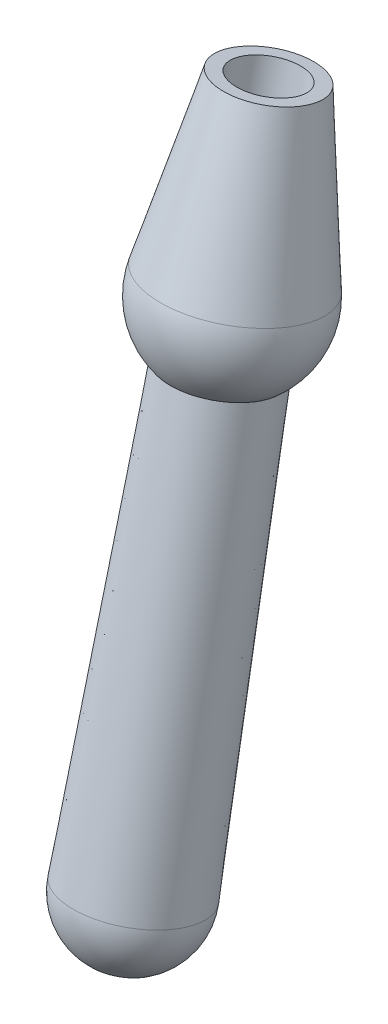
ISO-10303-21;
HEADER;
FILE_DESCRIPTION(('STEP AP214'),'2;1');
FILE_NAME('part.step','',(''),(''),'','','');
FILE_SCHEMA(('AUTOMOTIVE_DESIGN { 1 0 10303 214 1 1 1 1 }'));
ENDSEC;
DATA;
#1=APPLICATION_CONTEXT('core data for automotive mechanical design processes');
#2=APPLICATION_PROTOCOL_DEFINITION('international standard','automotive_design',2000,#1);
#3=PRODUCT_CONTEXT('',#1,'mechanical');
#4=PRODUCT('Part','Part','',(#3));
#5=PRODUCT_RELATED_PRODUCT_CATEGORY('part','',(#4));
#6=PRODUCT_DEFINITION_FORMATION('','',#4);
#7=PRODUCT_DEFINITION_CONTEXT('part definition',#1,'design');
#8=PRODUCT_DEFINITION('design','',#6,#7);
#9=PRODUCT_DEFINITION_SHAPE('','',#8);
#10=(LENGTH_UNIT() NAMED_UNIT(*) SI_UNIT(.MILLI.,.METRE.));
#11=(NAMED_UNIT(*) PLANE_ANGLE_UNIT() SI_UNIT($,.RADIAN.));
#12=(NAMED_UNIT(*) SI_UNIT($,.STERADIAN.) SOLID_ANGLE_UNIT());
#13=UNCERTAINTY_MEASURE_WITH_UNIT(LENGTH_MEASURE(1.E-05),#10,'distance_accuracy_value','');
#14=(GEOMETRIC_REPRESENTATION_CONTEXT(3) GLOBAL_UNCERTAINTY_ASSIGNED_CONTEXT((#13)) GLOBAL_UNIT_ASSIGNED_CONTEXT((#10,
#11,#12)) REPRESENTATION_CONTEXT('',''));
#15=CARTESIAN_POINT('',(0.,0.,0.));
#16=DIRECTION('',(0.,0.,1.));
#17=DIRECTION('',(1.,0.,0.));
#18=AXIS2_PLACEMENT_3D('',#15,#16,#17);
#19=CARTESIAN_POINT('',(0.,-5.43277859889929,1.55863020646956));
#20=DIRECTION('',(0.,0.978147600733806,-0.207911690817759));
#21=DIRECTION('',(0.,-0.207911690817759,-0.978147600733806));
#22=AXIS2_PLACEMENT_3D('',#19,#20,#21);
#23=SPHERICAL_SURFACE('',#22,0.8);
#24=CARTESIAN_POINT('',(0.,-5.4327785988993,1.55863020646956));
#25=DIRECTION('',(0.,0.978147600733806,-0.207911690817759));
#26=DIRECTION('',(0.,-0.207911690817759,-0.978147600733806));
#27=AXIS2_PLACEMENT_3D('',#24,#25,#26);
#28=CIRCLE('',#27,0.8);
#29=CARTESIAN_POINT('',(0.,-5.5991079515535,0.776112125882512));
#30=VERTEX_POINT('',#29);
#31=EDGE_CURVE('E11',#30,#30,#28,.T.);
#32=ORIENTED_EDGE('',*,*,#31,.T.);
#33=EDGE_LOOP('',(#32));
#34=FACE_BOUND('',#33,.T.);
#35=ADVANCED_FACE('F17',(#34),#23,.F.);
#36=CARTESIAN_POINT('',(0.,6.10936308975959,-0.894727745179999));
#37=DIRECTION('',(0.,0.978147600733806,-0.207911690817759));
#38=DIRECTION('',(0.,-0.207911690817759,-0.978147600733806));
#39=AXIS2_PLACEMENT_3D('',#36,#37,#38);
#40=CYLINDRICAL_SURFACE('',#39,0.8);
#41=ORIENTED_EDGE('',*,*,#31,.F.);
#42=EDGE_LOOP('',(#41));
#43=FACE_BOUND('',#42,.T.);
#44=CARTESIAN_POINT('',(0.,6.10936308975959,-0.894727745179999));
#45=DIRECTION('',(0.,0.978147600733806,-0.207911690817759));
#46=DIRECTION('',(0.,-0.207911690817759,-0.978147600733806));
#47=AXIS2_PLACEMENT_3D('',#44,#45,#46);
#48=CIRCLE('',#47,0.8);
#49=CARTESIAN_POINT('',(0.,5.94303373710538,-1.67724582576704));
#50=VERTEX_POINT('',#49);
#51=EDGE_CURVE('E21',#50,#50,#48,.T.);
#52=ORIENTED_EDGE('',*,*,#51,.T.);
#53=EDGE_LOOP('',(#52));
#54=FACE_BOUND('',#53,.T.);
#55=ADVANCED_FACE('F80',(#43,#54),#40,.F.);
#56=CARTESIAN_POINT('',(0.,6.10936308975959,-0.894727745179999));
#57=DIRECTION('',(0.,0.978147600733806,-0.207911690817759));
#58=DIRECTION('',(-1.,0.,0.));
#59=AXIS2_PLACEMENT_3D('',#56,#57,#58);
#60=PLANE('',#59);
#61=CARTESIAN_POINT('',(0.,6.10936308975959,-0.894727745179999));
#62=DIRECTION('',(0.,0.978147600733806,-0.207911690817759));
#63=DIRECTION('',(0.,-0.207911690817759,-0.978147600733806));
#64=AXIS2_PLACEMENT_3D('',#61,#62,#63);
#65=CIRCLE('',#64,1.12996469448049);
#66=CARTESIAN_POINT('',(0.,5.87443021956578,-2.));
#67=VERTEX_POINT('',#66);
#68=EDGE_CURVE('E66',#67,#67,#65,.T.);
#69=ORIENTED_EDGE('',*,*,#68,.T.);
#70=EDGE_LOOP('',(#69));
#71=FACE_BOUND('',#70,.T.);
#72=ORIENTED_EDGE('',*,*,#51,.F.);
#73=EDGE_LOOP('',(#72));
#74=FACE_BOUND('',#73,.T.);
#75=ADVANCED_FACE('F82',(#71,#74),#60,.T.);
#76=CARTESIAN_POINT('',(0.,4.17509450153618,-0.483586264720904));
#77=DIRECTION('',(0.,-0.978147600733806,0.207911690817759));
#78=DIRECTION('',(0.,0.207911690817759,0.978147600733806));
#79=AXIS2_PLACEMENT_3D('',#76,#77,#78);
#80=CONICAL_SURFACE('',#79,1.49887065025723,0.184433389020991);
#81=CARTESIAN_POINT('',(0.,2.24082591331277,-0.0724447842618082));
#82=DIRECTION('',(0.,0.978147600733806,-0.207911690817759));
#83=DIRECTION('',(0.,-0.207911690817759,-0.978147600733806));
#84=AXIS2_PLACEMENT_3D('',#81,#82,#83);
#85=CIRCLE('',#84,1.86777660603397);
#86=CARTESIAN_POINT('',(0.,1.8524933210824,-1.89940599016067));
#87=VERTEX_POINT('',#86);
#88=EDGE_CURVE('E58',#87,#87,#85,.T.);
#89=ORIENTED_EDGE('',*,*,#88,.T.);
#90=EDGE_LOOP('',(#89));
#91=FACE_BOUND('',#90,.T.);
#92=ORIENTED_EDGE('',*,*,#68,.F.);
#93=EDGE_LOOP('',(#92));
#94=FACE_BOUND('',#93,.T.);
#95=ADVANCED_FACE('F84',(#91,#94),#80,.T.);
#96=CARTESIAN_POINT('',(0.,1.9,0.));
#97=DIRECTION('',(0.,0.978147600733806,-0.207911690817759));
#98=DIRECTION('',(0.,-0.207911690817759,-0.978147600733806));
#99=AXIS2_PLACEMENT_3D('',#96,#97,#98);
#100=SPHERICAL_SURFACE('',#99,1.9);
#101=CARTESIAN_POINT('',(0.,0.490758694812245,0.299543486394084));
#102=DIRECTION('',(0.,0.978147600733806,-0.207911690817759));
#103=DIRECTION('',(0.,-0.207911690817759,-0.978147600733806));
#104=AXIS2_PLACEMENT_3D('',#101,#102,#103);
#105=CIRCLE('',#104,1.23867374377259);
#106=CARTESIAN_POINT('',(0.,0.233223942372924,-0.912062264169032));
#107=VERTEX_POINT('',#106);
#108=EDGE_CURVE('E54',#107,#107,#105,.T.);
#109=ORIENTED_EDGE('',*,*,#108,.T.);
#110=EDGE_LOOP('',(#109));
#111=FACE_BOUND('',#110,.T.);
#112=ORIENTED_EDGE('',*,*,#88,.F.);
#113=EDGE_LOOP('',(#112));
#114=FACE_BOUND('',#113,.T.);
#115=ADVANCED_FACE('F91',(#111,#114),#100,.T.);
#116=CARTESIAN_POINT('',(0.,-4.50227282022427,1.36084509754031));
#117=DIRECTION('',(0.,-0.978147600733806,0.207911690817759));
#118=DIRECTION('',(0.,0.207911690817759,0.978147600733806));
#119=AXIS2_PLACEMENT_3D('',#116,#117,#118);
#120=CONICAL_SURFACE('',#119,1.36909220397096,0.02554375170795);
#121=CARTESIAN_POINT('',(0.,-9.49530433526078,2.42214670868653));
#122=DIRECTION('',(0.,0.978147600733806,-0.207911690817759));
#123=DIRECTION('',(0.,-0.207911690817759,-0.978147600733806));
#124=AXIS2_PLACEMENT_3D('',#121,#122,#123);
#125=CIRCLE('',#124,1.49951066416933);
#126=CARTESIAN_POINT('',(0.,-9.80707013284749,0.955403950254541));
#127=VERTEX_POINT('',#126);
#128=EDGE_CURVE('E59',#127,#127,#125,.T.);
#129=ORIENTED_EDGE('',*,*,#128,.T.);
#130=EDGE_LOOP('',(#129));
#131=FACE_BOUND('',#130,.T.);
#132=ORIENTED_EDGE('',*,*,#108,.F.);
#133=EDGE_LOOP('',(#132));
#134=FACE_BOUND('',#133,.T.);
#135=ADVANCED_FACE('F55',(#131,#134),#120,.T.);
#136=CARTESIAN_POINT('',(0.,-9.53277859889929,2.43011210931665));
#137=DIRECTION('',(0.,0.978147600733806,-0.207911690817759));
#138=DIRECTION('',(0.,-0.207911690817759,-0.978147600733806));
#139=AXIS2_PLACEMENT_3D('',#136,#137,#138);
#140=SPHERICAL_SURFACE('',#139,1.5);
#141=ORIENTED_EDGE('',*,*,#128,.F.);
#142=EDGE_LOOP('',(#141));
#143=FACE_BOUND('',#142,.T.);
#144=ADVANCED_FACE('F19',(#143),#140,.T.);
#145=CLOSED_SHELL('',(#35,#55,#75,#95,#115,#135,#144));
#146=MANIFOLD_SOLID_BREP('B1',#145);
#147=ADVANCED_BREP_SHAPE_REPRESENTATION('',(#18,#146),#14);
#148=SHAPE_DEFINITION_REPRESENTATION(#9,#147);
ENDSEC;
END-ISO-10303-21;
